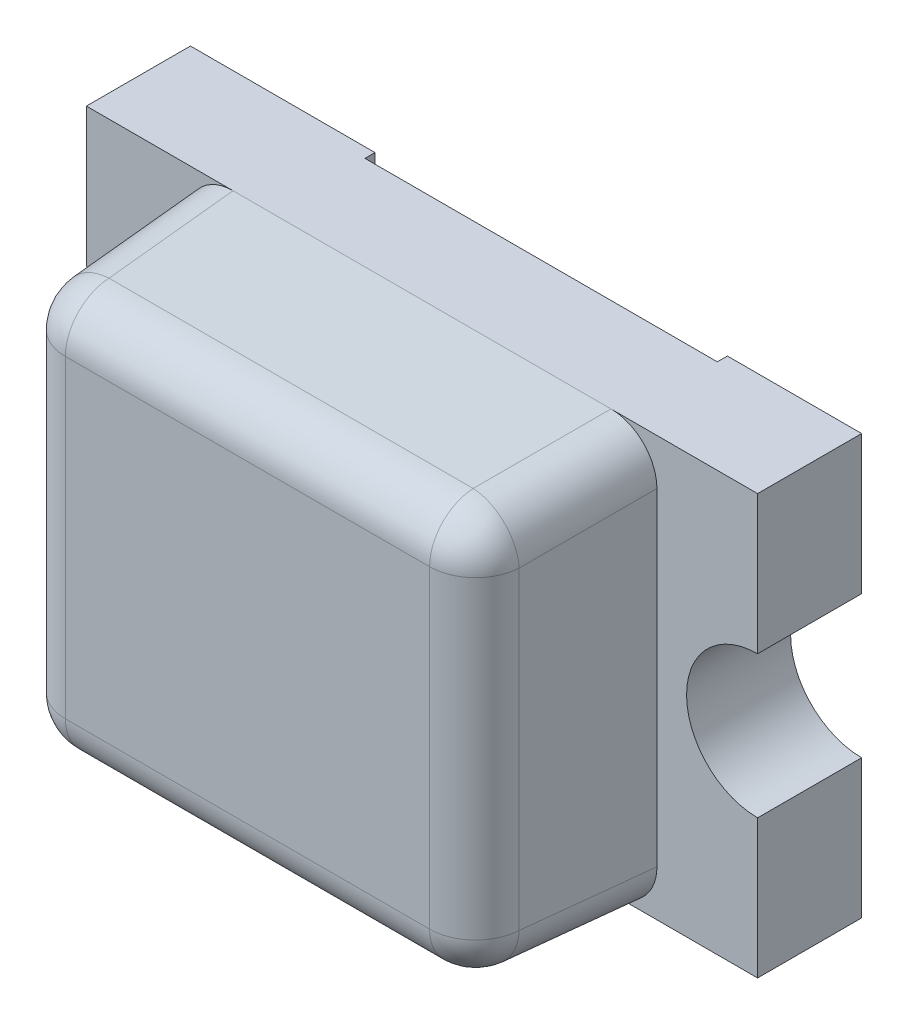
ISO-10303-21;
HEADER;
FILE_DESCRIPTION(('STEP AP214'),'2;1');
FILE_NAME('part.step','',(''),(''),'','','');
FILE_SCHEMA(('AUTOMOTIVE_DESIGN { 1 0 10303 214 1 1 1 1 }'));
ENDSEC;
DATA;
#1=APPLICATION_CONTEXT('core data for automotive mechanical design processes');
#2=APPLICATION_PROTOCOL_DEFINITION('international standard','automotive_design',2000,#1);
#3=PRODUCT_CONTEXT('',#1,'mechanical');
#4=PRODUCT('Part','Part','',(#3));
#5=PRODUCT_RELATED_PRODUCT_CATEGORY('part','',(#4));
#6=PRODUCT_DEFINITION_FORMATION('','',#4);
#7=PRODUCT_DEFINITION_CONTEXT('part definition',#1,'design');
#8=PRODUCT_DEFINITION('design','',#6,#7);
#9=PRODUCT_DEFINITION_SHAPE('','',#8);
#10=(LENGTH_UNIT() NAMED_UNIT(*) SI_UNIT(.MILLI.,.METRE.));
#11=(NAMED_UNIT(*) PLANE_ANGLE_UNIT() SI_UNIT($,.RADIAN.));
#12=(NAMED_UNIT(*) SI_UNIT($,.STERADIAN.) SOLID_ANGLE_UNIT());
#13=UNCERTAINTY_MEASURE_WITH_UNIT(LENGTH_MEASURE(1.E-05),#10,'distance_accuracy_value','');
#14=(GEOMETRIC_REPRESENTATION_CONTEXT(3) GLOBAL_UNCERTAINTY_ASSIGNED_CONTEXT((#13)) GLOBAL_UNIT_ASSIGNED_CONTEXT((#10,
#11,#12)) REPRESENTATION_CONTEXT('',''));
#15=CARTESIAN_POINT('',(0.,0.,0.));
#16=DIRECTION('',(0.,0.,1.));
#17=DIRECTION('',(1.,0.,0.));
#18=AXIS2_PLACEMENT_3D('',#15,#16,#17);
#19=CARTESIAN_POINT('',(0.163168531233106,-0.486831468766896,0.325652261310296));
#20=DIRECTION('',(-0.0522644276887139,-0.0522644276887139,-0.997264688634237));
#21=DIRECTION('',(0.,0.998629534754574,-0.0523359562429438));
#22=AXIS2_PLACEMENT_3D('',#19,#20,#21);
#23=CYLINDRICAL_SURFACE('',#22,0.13716);
#24=CARTESIAN_POINT('',(0.182412025197795,-0.467587974802207,0.69284));
#25=DIRECTION('',(0.052264427688714,0.052264427688714,0.997264688634237));
#26=DIRECTION('',(0.,-0.998629534754574,0.0523359562429439));
#27=AXIS2_PLACEMENT_3D('',#24,#25,#26);
#28=CIRCLE('',#27,0.13716);
#29=CARTESIAN_POINT('',(0.0454399982108576,-0.467587974802207,0.700018399758282));
#30=VERTEX_POINT('',#29);
#31=CARTESIAN_POINT('',(0.182412025197795,-0.604560001789144,0.700018399758282));
#32=VERTEX_POINT('',#31);
#33=EDGE_CURVE('E496',#30,#32,#28,.T.);
#34=ORIENTED_EDGE('',*,*,#33,.F.);
#35=DIRECTION('',(0.0522644276887139,0.0522644276887139,0.997264688634237));
#36=VECTOR('',#35,1.);
#37=CARTESIAN_POINT('',(0.02633308276625,-0.486694890246814,0.335436734478859));
#38=LINE('',#37,#36);
#39=CARTESIAN_POINT('',(0.0250000000000006,-0.488027973013064,0.31));
#40=VERTEX_POINT('',#39);
#41=EDGE_CURVE('E43',#40,#30,#38,.T.);
#42=ORIENTED_EDGE('',*,*,#41,.F.);
#43=CARTESIAN_POINT('',(0.162348230977076,-0.487651769022926,0.31));
#44=DIRECTION('',(0.,0.,1.));
#45=DIRECTION('',(-0.707106781186547,-0.707106781186548,0.));
#46=AXIS2_PLACEMENT_3D('',#43,#44,#45);
#47=ELLIPSE('',#46,0.137536204342943,0.13716);
#48=CARTESIAN_POINT('',(0.161972026986938,-0.625,0.31));
#49=VERTEX_POINT('',#48);
#50=EDGE_CURVE('E11',#40,#49,#47,.T.);
#51=ORIENTED_EDGE('',*,*,#50,.T.);
#52=DIRECTION('',(0.0522644276887139,0.0522644276887139,0.997264688634237));
#53=VECTOR('',#52,1.);
#54=CARTESIAN_POINT('',(0.163168531233106,-0.623803495753833,0.332830661068578));
#55=LINE('',#54,#53);
#56=EDGE_CURVE('E29',#49,#32,#55,.T.);
#57=ORIENTED_EDGE('',*,*,#56,.T.);
#58=EDGE_LOOP('',(#34,#42,#51,#57));
#59=FACE_BOUND('',#58,.T.);
#60=ADVANCED_FACE('F18',(#59),#23,.T.);
#61=CARTESIAN_POINT('',(0.182412025197795,-0.467587974802207,0.69284));
#62=DIRECTION('',(0.,0.,1.));
#63=DIRECTION('',(1.,0.,0.));
#64=AXIS2_PLACEMENT_3D('',#61,#62,#63);
#65=SPHERICAL_SURFACE('',#64,0.13716);
#66=CARTESIAN_POINT('',(0.182412025197795,-0.467587974802207,0.69284));
#67=DIRECTION('',(-1.,0.,0.));
#68=DIRECTION('',(0.,0.,1.));
#69=AXIS2_PLACEMENT_3D('',#66,#67,#68);
#70=CIRCLE('',#69,0.13716);
#71=CARTESIAN_POINT('',(0.182412025197795,-0.467587974802207,0.83));
#72=VERTEX_POINT('',#71);
#73=EDGE_CURVE('E22',#32,#72,#70,.T.);
#74=ORIENTED_EDGE('',*,*,#73,.T.);
#75=CARTESIAN_POINT('',(0.182412025197795,-0.467587974802207,0.69284));
#76=DIRECTION('',(0.,-1.,0.));
#77=DIRECTION('',(0.,0.,-1.));
#78=AXIS2_PLACEMENT_3D('',#75,#76,#77);
#79=CIRCLE('',#78,0.13716);
#80=EDGE_CURVE('E492',#72,#30,#79,.T.);
#81=ORIENTED_EDGE('',*,*,#80,.T.);
#82=ORIENTED_EDGE('',*,*,#33,.T.);
#83=EDGE_LOOP('',(#74,#81,#82));
#84=FACE_BOUND('',#83,.T.);
#85=ADVANCED_FACE('F776',(#84),#65,.T.);
#86=CARTESIAN_POINT('',(0.,-0.467587974802207,0.69284));
#87=DIRECTION('',(1.,0.,0.));
#88=DIRECTION('',(0.,1.,0.));
#89=AXIS2_PLACEMENT_3D('',#86,#87,#88);
#90=CYLINDRICAL_SURFACE('',#89,0.13716);
#91=CARTESIAN_POINT('',(1.26758797480221,-0.467587974802207,0.69284));
#92=DIRECTION('',(1.,0.,0.));
#93=DIRECTION('',(0.,0.,-1.));
#94=AXIS2_PLACEMENT_3D('',#91,#92,#93);
#95=CIRCLE('',#94,0.13716);
#96=CARTESIAN_POINT('',(1.26758797480221,-0.467587974802207,0.83));
#97=VERTEX_POINT('',#96);
#98=CARTESIAN_POINT('',(1.26758797480221,-0.604560001789144,0.700018399758282));
#99=VERTEX_POINT('',#98);
#100=EDGE_CURVE('E370',#97,#99,#95,.T.);
#101=ORIENTED_EDGE('',*,*,#100,.F.);
#102=DIRECTION('',(-1.,0.,0.));
#103=VECTOR('',#102,1.);
#104=CARTESIAN_POINT('',(1.39774795477282,-0.467587974802207,0.83));
#105=LINE('',#104,#103);
#106=EDGE_CURVE('E297',#97,#72,#105,.T.);
#107=ORIENTED_EDGE('',*,*,#106,.T.);
#108=ORIENTED_EDGE('',*,*,#73,.F.);
#109=DIRECTION('',(1.,0.,0.));
#110=VECTOR('',#109,1.);
#111=CARTESIAN_POINT('',(0.0522520452271821,-0.604560001789144,0.700018399758282));
#112=LINE('',#111,#110);
#113=EDGE_CURVE('E444',#32,#99,#112,.T.);
#114=ORIENTED_EDGE('',*,*,#113,.T.);
#115=EDGE_LOOP('',(#101,#107,#108,#114));
#116=FACE_BOUND('',#115,.T.);
#117=ADVANCED_FACE('F781',(#116),#90,.T.);
#118=CARTESIAN_POINT('',(0.182412025197795,0.,0.69284));
#119=DIRECTION('',(0.,-1.,0.));
#120=DIRECTION('',(1.,0.,0.));
#121=AXIS2_PLACEMENT_3D('',#118,#119,#120);
#122=CYLINDRICAL_SURFACE('',#121,0.13716);
#123=CARTESIAN_POINT('',(0.182412025197795,0.467587974802206,0.69284));
#124=DIRECTION('',(0.,1.,0.));
#125=DIRECTION('',(0.,0.,1.));
#126=AXIS2_PLACEMENT_3D('',#123,#124,#125);
#127=CIRCLE('',#126,0.13716);
#128=CARTESIAN_POINT('',(0.0454399982108576,0.467587974802206,0.700018399758282));
#129=VERTEX_POINT('',#128);
#130=CARTESIAN_POINT('',(0.182412025197795,0.467587974802206,0.83));
#131=VERTEX_POINT('',#130);
#132=EDGE_CURVE('E279',#129,#131,#127,.T.);
#133=ORIENTED_EDGE('',*,*,#132,.F.);
#134=DIRECTION('',(0.,-1.,0.));
#135=VECTOR('',#134,1.);
#136=CARTESIAN_POINT('',(0.0454399982108575,0.597747954772819,0.700018399758282));
#137=LINE('',#136,#135);
#138=EDGE_CURVE('E345',#129,#30,#137,.T.);
#139=ORIENTED_EDGE('',*,*,#138,.T.);
#140=ORIENTED_EDGE('',*,*,#80,.F.);
#141=DIRECTION('',(0.,1.,0.));
#142=VECTOR('',#141,1.);
#143=CARTESIAN_POINT('',(0.182412025197795,-0.597747954772819,0.83));
#144=LINE('',#143,#142);
#145=EDGE_CURVE('E341',#72,#131,#144,.T.);
#146=ORIENTED_EDGE('',*,*,#145,.T.);
#147=EDGE_LOOP('',(#133,#139,#140,#146));
#148=FACE_BOUND('',#147,.T.);
#149=ADVANCED_FACE('F795',(#148),#122,.T.);
#150=CARTESIAN_POINT('',(1.26758797480221,-0.467587974802207,0.69284));
#151=DIRECTION('',(0.,0.,1.));
#152=DIRECTION('',(1.,0.,0.));
#153=AXIS2_PLACEMENT_3D('',#150,#151,#152);
#154=SPHERICAL_SURFACE('',#153,0.13716);
#155=CARTESIAN_POINT('',(1.26758797480221,-0.467587974802206,0.69284));
#156=DIRECTION('',(-0.052264427688714,0.052264427688714,0.997264688634237));
#157=DIRECTION('',(0.,-0.998629534754574,0.0523359562429439));
#158=AXIS2_PLACEMENT_3D('',#155,#156,#157);
#159=CIRCLE('',#158,0.13716);
#160=CARTESIAN_POINT('',(1.40456000178914,-0.467587974802207,0.700018399758282));
#161=VERTEX_POINT('',#160);
#162=EDGE_CURVE('E346',#99,#161,#159,.T.);
#163=ORIENTED_EDGE('',*,*,#162,.T.);
#164=CARTESIAN_POINT('',(1.26758797480221,-0.467587974802207,0.69284));
#165=DIRECTION('',(0.,-1.,0.));
#166=DIRECTION('',(0.,0.,-1.));
#167=AXIS2_PLACEMENT_3D('',#164,#165,#166);
#168=CIRCLE('',#167,0.13716);
#169=EDGE_CURVE('E372',#161,#97,#168,.T.);
#170=ORIENTED_EDGE('',*,*,#169,.T.);
#171=ORIENTED_EDGE('',*,*,#100,.T.);
#172=EDGE_LOOP('',(#163,#170,#171));
#173=FACE_BOUND('',#172,.T.);
#174=ADVANCED_FACE('F789',(#173),#154,.T.);
#175=CARTESIAN_POINT('',(0.182412025197795,0.467587974802206,0.69284));
#176=DIRECTION('',(0.,0.,1.));
#177=DIRECTION('',(1.,0.,0.));
#178=AXIS2_PLACEMENT_3D('',#175,#176,#177);
#179=SPHERICAL_SURFACE('',#178,0.13716);
#180=CARTESIAN_POINT('',(0.182412025197795,0.467587974802206,0.69284));
#181=DIRECTION('',(-1.,0.,0.));
#182=DIRECTION('',(0.,-1.,0.));
#183=AXIS2_PLACEMENT_3D('',#180,#181,#182);
#184=CIRCLE('',#183,0.13716);
#185=CARTESIAN_POINT('',(0.182412025197795,0.604560001789144,0.700018399758282));
#186=VERTEX_POINT('',#185);
#187=EDGE_CURVE('E366',#131,#186,#184,.T.);
#188=ORIENTED_EDGE('',*,*,#187,.T.);
#189=CARTESIAN_POINT('',(0.182412025197795,0.467587974802206,0.69284));
#190=DIRECTION('',(0.052264427688714,-0.052264427688714,0.997264688634237));
#191=DIRECTION('',(0.998629534754574,0.,-0.0523359562429439));
#192=AXIS2_PLACEMENT_3D('',#189,#190,#191);
#193=CIRCLE('',#192,0.13716);
#194=EDGE_CURVE('E371',#186,#129,#193,.T.);
#195=ORIENTED_EDGE('',*,*,#194,.T.);
#196=ORIENTED_EDGE('',*,*,#132,.T.);
#197=EDGE_LOOP('',(#188,#195,#196));
#198=FACE_BOUND('',#197,.T.);
#199=ADVANCED_FACE('F794',(#198),#179,.T.);
#200=CARTESIAN_POINT('',(1.28669489024681,-0.486694890246814,0.328258334720577));
#201=DIRECTION('',(0.0522644276887139,-0.0522644276887139,-0.997264688634237));
#202=DIRECTION('',(-0.998629534754574,0.,-0.0523359562429438));
#203=AXIS2_PLACEMENT_3D('',#200,#201,#202);
#204=CYLINDRICAL_SURFACE('',#203,0.13716);
#205=CARTESIAN_POINT('',(1.28765176902293,-0.487651769022926,0.31));
#206=DIRECTION('',(0.,0.,1.));
#207=DIRECTION('',(0.707106781186548,-0.707106781186547,0.));
#208=AXIS2_PLACEMENT_3D('',#205,#206,#207);
#209=ELLIPSE('',#208,0.137536204342943,0.13716);
#210=CARTESIAN_POINT('',(1.28802797301306,-0.625,0.31));
#211=VERTEX_POINT('',#210);
#212=CARTESIAN_POINT('',(1.425,-0.488027973013063,0.31));
#213=VERTEX_POINT('',#212);
#214=EDGE_CURVE('E270',#211,#213,#209,.T.);
#215=ORIENTED_EDGE('',*,*,#214,.T.);
#216=DIRECTION('',(-0.0522644276887139,0.0522644276887139,0.997264688634237));
#217=VECTOR('',#216,1.);
#218=CARTESIAN_POINT('',(1.42366691723375,-0.486694890246814,0.335436734478859));
#219=LINE('',#218,#217);
#220=EDGE_CURVE('E268',#213,#161,#219,.T.);
#221=ORIENTED_EDGE('',*,*,#220,.T.);
#222=ORIENTED_EDGE('',*,*,#162,.F.);
#223=DIRECTION('',(-0.0522644276887139,0.0522644276887139,0.997264688634237));
#224=VECTOR('',#223,1.);
#225=CARTESIAN_POINT('',(1.28614857616649,-0.623120603153426,0.345861028119986));
#226=LINE('',#225,#224);
#227=EDGE_CURVE('E383',#211,#99,#226,.T.);
#228=ORIENTED_EDGE('',*,*,#227,.F.);
#229=EDGE_LOOP('',(#215,#221,#222,#228));
#230=FACE_BOUND('',#229,.T.);
#231=ADVANCED_FACE('F639',(#230),#204,.T.);
#232=CARTESIAN_POINT('',(1.26758797480221,0.,0.69284));
#233=DIRECTION('',(0.,1.,0.));
#234=DIRECTION('',(-1.,0.,0.));
#235=AXIS2_PLACEMENT_3D('',#232,#233,#234);
#236=CYLINDRICAL_SURFACE('',#235,0.13716);
#237=CARTESIAN_POINT('',(1.26758797480221,0.467587974802206,0.69284));
#238=DIRECTION('',(0.,1.,0.));
#239=DIRECTION('',(0.,0.,1.));
#240=AXIS2_PLACEMENT_3D('',#237,#238,#239);
#241=CIRCLE('',#240,0.13716);
#242=CARTESIAN_POINT('',(1.26758797480221,0.467587974802206,0.83));
#243=VERTEX_POINT('',#242);
#244=CARTESIAN_POINT('',(1.40456000178914,0.467587974802206,0.700018399758282));
#245=VERTEX_POINT('',#244);
#246=EDGE_CURVE('E312',#243,#245,#241,.T.);
#247=ORIENTED_EDGE('',*,*,#246,.F.);
#248=DIRECTION('',(0.,-1.,0.));
#249=VECTOR('',#248,1.);
#250=CARTESIAN_POINT('',(1.26758797480221,0.597747954772819,0.83));
#251=LINE('',#250,#249);
#252=EDGE_CURVE('E271',#243,#97,#251,.T.);
#253=ORIENTED_EDGE('',*,*,#252,.T.);
#254=ORIENTED_EDGE('',*,*,#169,.F.);
#255=DIRECTION('',(0.,1.,0.));
#256=VECTOR('',#255,1.);
#257=CARTESIAN_POINT('',(1.40456000178914,-0.597747954772819,0.700018399758282));
#258=LINE('',#257,#256);
#259=EDGE_CURVE('E283',#161,#245,#258,.T.);
#260=ORIENTED_EDGE('',*,*,#259,.T.);
#261=EDGE_LOOP('',(#247,#253,#254,#260));
#262=FACE_BOUND('',#261,.T.);
#263=ADVANCED_FACE('F763',(#262),#236,.T.);
#264=CARTESIAN_POINT('',(0.,0.467587974802206,0.69284));
#265=DIRECTION('',(-1.,0.,0.));
#266=DIRECTION('',(0.,0.,1.));
#267=AXIS2_PLACEMENT_3D('',#264,#265,#266);
#268=CYLINDRICAL_SURFACE('',#267,0.13716);
#269=CARTESIAN_POINT('',(1.26758797480221,0.467587974802206,0.69284));
#270=DIRECTION('',(1.,0.,0.));
#271=DIRECTION('',(0.,0.,-1.));
#272=AXIS2_PLACEMENT_3D('',#269,#270,#271);
#273=CIRCLE('',#272,0.13716);
#274=CARTESIAN_POINT('',(1.26758797480221,0.604560001789144,0.700018399758282));
#275=VERTEX_POINT('',#274);
#276=EDGE_CURVE('E299',#275,#243,#273,.T.);
#277=ORIENTED_EDGE('',*,*,#276,.F.);
#278=DIRECTION('',(-1.,0.,0.));
#279=VECTOR('',#278,1.);
#280=CARTESIAN_POINT('',(1.39774795477282,0.604560001789144,0.700018399758282));
#281=LINE('',#280,#279);
#282=EDGE_CURVE('E293',#275,#186,#281,.T.);
#283=ORIENTED_EDGE('',*,*,#282,.T.);
#284=ORIENTED_EDGE('',*,*,#187,.F.);
#285=DIRECTION('',(1.,0.,0.));
#286=VECTOR('',#285,1.);
#287=CARTESIAN_POINT('',(0.052252045227182,0.467587974802206,0.83));
#288=LINE('',#287,#286);
#289=EDGE_CURVE('E447',#131,#243,#288,.T.);
#290=ORIENTED_EDGE('',*,*,#289,.T.);
#291=EDGE_LOOP('',(#277,#283,#284,#290));
#292=FACE_BOUND('',#291,.T.);
#293=ADVANCED_FACE('F768',(#292),#268,.T.);
#294=CARTESIAN_POINT('',(0.163305109753187,0.486694890246814,0.328258334720577));
#295=DIRECTION('',(-0.0522644276887139,0.0522644276887139,-0.997264688634237));
#296=DIRECTION('',(-0.998629534754574,0.,0.0523359562429438));
#297=AXIS2_PLACEMENT_3D('',#294,#295,#296);
#298=CYLINDRICAL_SURFACE('',#297,0.13716);
#299=CARTESIAN_POINT('',(0.162348230977075,0.487651769022926,0.31));
#300=DIRECTION('',(0.,0.,1.));
#301=DIRECTION('',(-0.707106781186548,0.707106781186548,0.));
#302=AXIS2_PLACEMENT_3D('',#299,#300,#301);
#303=ELLIPSE('',#302,0.137536204342943,0.13716);
#304=CARTESIAN_POINT('',(0.161972026986938,0.625,0.31));
#305=VERTEX_POINT('',#304);
#306=CARTESIAN_POINT('',(0.0250000000000006,0.488027973013063,0.31));
#307=VERTEX_POINT('',#306);
#308=EDGE_CURVE('E549',#305,#307,#303,.T.);
#309=ORIENTED_EDGE('',*,*,#308,.T.);
#310=DIRECTION('',(0.0522644276887139,-0.0522644276887139,0.997264688634237));
#311=VECTOR('',#310,1.);
#312=CARTESIAN_POINT('',(0.02633308276625,0.486694890246814,0.335436734478859));
#313=LINE('',#312,#311);
#314=EDGE_CURVE('E262',#307,#129,#313,.T.);
#315=ORIENTED_EDGE('',*,*,#314,.T.);
#316=ORIENTED_EDGE('',*,*,#194,.F.);
#317=DIRECTION('',(0.0522644276887139,-0.0522644276887139,0.997264688634237));
#318=VECTOR('',#317,1.);
#319=CARTESIAN_POINT('',(0.163168531233106,0.623803495753833,0.332830661068578));
#320=LINE('',#319,#318);
#321=EDGE_CURVE('E412',#305,#186,#320,.T.);
#322=ORIENTED_EDGE('',*,*,#321,.F.);
#323=EDGE_LOOP('',(#309,#315,#316,#322));
#324=FACE_BOUND('',#323,.T.);
#325=ADVANCED_FACE('F596',(#324),#298,.T.);
#326=CARTESIAN_POINT('',(1.26758797480221,0.467587974802206,0.69284));
#327=DIRECTION('',(0.,0.,1.));
#328=DIRECTION('',(1.,0.,0.));
#329=AXIS2_PLACEMENT_3D('',#326,#327,#328);
#330=SPHERICAL_SURFACE('',#329,0.13716);
#331=ORIENTED_EDGE('',*,*,#246,.T.);
#332=CARTESIAN_POINT('',(1.26758797480221,0.467587974802206,0.69284));
#333=DIRECTION('',(-0.052264427688714,-0.0522644276887141,0.997264688634237));
#334=DIRECTION('',(0.,-0.998629534754574,-0.052335956242944));
#335=AXIS2_PLACEMENT_3D('',#332,#333,#334);
#336=CIRCLE('',#335,0.13716);
#337=EDGE_CURVE('E301',#245,#275,#336,.T.);
#338=ORIENTED_EDGE('',*,*,#337,.T.);
#339=ORIENTED_EDGE('',*,*,#276,.T.);
#340=EDGE_LOOP('',(#331,#338,#339));
#341=FACE_BOUND('',#340,.T.);
#342=ADVANCED_FACE('F739',(#341),#330,.T.);
#343=CARTESIAN_POINT('',(1.28614857616649,0.486148576166488,0.338682628361704));
#344=DIRECTION('',(0.0522644276887139,0.0522644276887139,-0.997264688634237));
#345=DIRECTION('',(0.,0.998629534754574,0.0523359562429438));
#346=AXIS2_PLACEMENT_3D('',#343,#344,#345);
#347=CYLINDRICAL_SURFACE('',#346,0.13716);
#348=ORIENTED_EDGE('',*,*,#337,.F.);
#349=DIRECTION('',(-0.0522644276887139,-0.0522644276887139,0.997264688634237));
#350=VECTOR('',#349,1.);
#351=CARTESIAN_POINT('',(1.42366691723375,0.486694890246814,0.335436734478859));
#352=LINE('',#351,#350);
#353=CARTESIAN_POINT('',(1.425,0.488027973013063,0.31));
#354=VERTEX_POINT('',#353);
#355=EDGE_CURVE('E387',#354,#245,#352,.T.);
#356=ORIENTED_EDGE('',*,*,#355,.F.);
#357=CARTESIAN_POINT('',(1.28765176902293,0.487651769022926,0.31));
#358=DIRECTION('',(0.,0.,1.));
#359=DIRECTION('',(0.707106781186548,0.707106781186548,0.));
#360=AXIS2_PLACEMENT_3D('',#357,#358,#359);
#361=ELLIPSE('',#360,0.137536204342943,0.13716);
#362=CARTESIAN_POINT('',(1.28802797301306,0.625,0.31));
#363=VERTEX_POINT('',#362);
#364=EDGE_CURVE('E302',#354,#363,#361,.T.);
#365=ORIENTED_EDGE('',*,*,#364,.T.);
#366=DIRECTION('',(-0.0522644276887139,-0.0522644276887139,0.997264688634237));
#367=VECTOR('',#366,1.);
#368=CARTESIAN_POINT('',(1.28614857616649,0.623120603153425,0.345861028119986));
#369=LINE('',#368,#367);
#370=EDGE_CURVE('E408',#363,#275,#369,.T.);
#371=ORIENTED_EDGE('',*,*,#370,.T.);
#372=EDGE_LOOP('',(#348,#356,#365,#371));
#373=FACE_BOUND('',#372,.T.);
#374=ADVANCED_FACE('F632',(#373),#347,.T.);
#375=CARTESIAN_POINT('',(0.,0.,0.83));
#376=DIRECTION('',(0.,0.,1.));
#377=DIRECTION('',(1.,0.,0.));
#378=AXIS2_PLACEMENT_3D('',#375,#376,#377);
#379=PLANE('',#378);
#380=ORIENTED_EDGE('',*,*,#145,.F.);
#381=ORIENTED_EDGE('',*,*,#106,.F.);
#382=ORIENTED_EDGE('',*,*,#252,.F.);
#383=ORIENTED_EDGE('',*,*,#289,.F.);
#384=EDGE_LOOP('',(#380,#381,#382,#383));
#385=FACE_BOUND('',#384,.T.);
#386=ADVANCED_FACE('F816',(#385),#379,.T.);
#387=CARTESIAN_POINT('',(0.6,0.625,0.31));
#388=DIRECTION('',(0.,0.998629534754574,0.0523359562429438));
#389=DIRECTION('',(1.,0.,0.));
#390=AXIS2_PLACEMENT_3D('',#387,#388,#389);
#391=PLANE('',#390);
#392=DIRECTION('',(1.,0.,0.));
#393=VECTOR('',#392,1.);
#394=CARTESIAN_POINT('',(0.6,0.625,0.31));
#395=LINE('',#394,#393);
#396=EDGE_CURVE('E236',#305,#363,#395,.T.);
#397=ORIENTED_EDGE('',*,*,#396,.F.);
#398=ORIENTED_EDGE('',*,*,#321,.T.);
#399=ORIENTED_EDGE('',*,*,#282,.F.);
#400=ORIENTED_EDGE('',*,*,#370,.F.);
#401=EDGE_LOOP('',(#397,#398,#399,#400));
#402=FACE_BOUND('',#401,.T.);
#403=ADVANCED_FACE('F821',(#402),#391,.T.);
#404=CARTESIAN_POINT('',(1.425,0.,0.31));
#405=DIRECTION('',(0.998629534754574,0.,0.0523359562429438));
#406=DIRECTION('',(0.,-1.,0.));
#407=AXIS2_PLACEMENT_3D('',#404,#405,#406);
#408=PLANE('',#407);
#409=ORIENTED_EDGE('',*,*,#259,.F.);
#410=ORIENTED_EDGE('',*,*,#220,.F.);
#411=DIRECTION('',(0.,-1.,0.));
#412=VECTOR('',#411,1.);
#413=CARTESIAN_POINT('',(1.425,0.,0.31));
#414=LINE('',#413,#412);
#415=EDGE_CURVE('E336',#354,#213,#414,.T.);
#416=ORIENTED_EDGE('',*,*,#415,.F.);
#417=ORIENTED_EDGE('',*,*,#355,.T.);
#418=EDGE_LOOP('',(#409,#410,#416,#417));
#419=FACE_BOUND('',#418,.T.);
#420=ADVANCED_FACE('F637',(#419),#408,.T.);
#421=CARTESIAN_POINT('',(0.6,-0.625,0.31));
#422=DIRECTION('',(0.,-0.998629534754574,0.0523359562429438));
#423=DIRECTION('',(-1.,0.,0.));
#424=AXIS2_PLACEMENT_3D('',#421,#422,#423);
#425=PLANE('',#424);
#426=ORIENTED_EDGE('',*,*,#113,.F.);
#427=ORIENTED_EDGE('',*,*,#56,.F.);
#428=DIRECTION('',(-1.,0.,0.));
#429=VECTOR('',#428,1.);
#430=CARTESIAN_POINT('',(0.6,-0.625,0.31));
#431=LINE('',#430,#429);
#432=EDGE_CURVE('E328',#211,#49,#431,.T.);
#433=ORIENTED_EDGE('',*,*,#432,.F.);
#434=ORIENTED_EDGE('',*,*,#227,.T.);
#435=EDGE_LOOP('',(#426,#427,#433,#434));
#436=FACE_BOUND('',#435,.T.);
#437=ADVANCED_FACE('F808',(#436),#425,.T.);
#438=CARTESIAN_POINT('',(0.0250000000000006,0.,0.31));
#439=DIRECTION('',(-0.998629534754574,0.,0.0523359562429438));
#440=DIRECTION('',(0.,1.,0.));
#441=AXIS2_PLACEMENT_3D('',#438,#439,#440);
#442=PLANE('',#441);
#443=DIRECTION('',(0.,1.,0.));
#444=VECTOR('',#443,1.);
#445=CARTESIAN_POINT('',(0.0250000000000006,0.,0.31));
#446=LINE('',#445,#444);
#447=EDGE_CURVE('E349',#40,#307,#446,.T.);
#448=ORIENTED_EDGE('',*,*,#447,.F.);
#449=ORIENTED_EDGE('',*,*,#41,.T.);
#450=ORIENTED_EDGE('',*,*,#138,.F.);
#451=ORIENTED_EDGE('',*,*,#314,.F.);
#452=EDGE_LOOP('',(#448,#449,#450,#451));
#453=FACE_BOUND('',#452,.T.);
#454=ADVANCED_FACE('F591',(#453),#442,.T.);
#455=CARTESIAN_POINT('',(-0.275,0.,0.));
#456=DIRECTION('',(0.,0.,1.));
#457=DIRECTION('',(1.,0.,0.));
#458=AXIS2_PLACEMENT_3D('',#455,#456,#457);
#459=PLANE('',#458);
#460=DIRECTION('',(0.,1.,0.));
#461=VECTOR('',#460,1.);
#462=CARTESIAN_POINT('',(-0.275,0.211688070581402,0.));
#463=LINE('',#462,#461);
#464=CARTESIAN_POINT('',(-0.275,0.211688070581401,0.));
#465=VERTEX_POINT('',#464);
#466=CARTESIAN_POINT('',(-0.275,0.625,0.));
#467=VERTEX_POINT('',#466);
#468=EDGE_CURVE('E307',#465,#467,#463,.T.);
#469=ORIENTED_EDGE('',*,*,#468,.T.);
#470=DIRECTION('',(1.,0.,0.));
#471=VECTOR('',#470,1.);
#472=CARTESIAN_POINT('',(-0.275,0.625,0.));
#473=LINE('',#472,#471);
#474=CARTESIAN_POINT('',(0.275,0.625,0.));
#475=VERTEX_POINT('',#474);
#476=EDGE_CURVE('E303',#467,#475,#473,.T.);
#477=ORIENTED_EDGE('',*,*,#476,.T.);
#478=DIRECTION('',(0.,-1.,0.));
#479=VECTOR('',#478,1.);
#480=CARTESIAN_POINT('',(0.275,0.625,0.));
#481=LINE('',#480,#479);
#482=CARTESIAN_POINT('',(0.275,-0.625,0.));
#483=VERTEX_POINT('',#482);
#484=EDGE_CURVE('E308',#475,#483,#481,.T.);
#485=ORIENTED_EDGE('',*,*,#484,.T.);
#486=DIRECTION('',(-1.,0.,0.));
#487=VECTOR('',#486,1.);
#488=CARTESIAN_POINT('',(0.275,-0.625,0.));
#489=LINE('',#488,#487);
#490=CARTESIAN_POINT('',(-0.275,-0.625,0.));
#491=VERTEX_POINT('',#490);
#492=EDGE_CURVE('E402',#483,#491,#489,.T.);
#493=ORIENTED_EDGE('',*,*,#492,.T.);
#494=DIRECTION('',(0.,1.,0.));
#495=VECTOR('',#494,1.);
#496=CARTESIAN_POINT('',(-0.275,-0.625,0.));
#497=LINE('',#496,#495);
#498=CARTESIAN_POINT('',(-0.275,-0.211688070581402,0.));
#499=VERTEX_POINT('',#498);
#500=EDGE_CURVE('E323',#491,#499,#497,.T.);
#501=ORIENTED_EDGE('',*,*,#500,.T.);
#502=CARTESIAN_POINT('',(-0.275,0.,0.));
#503=DIRECTION('',(0.,0.,1.));
#504=DIRECTION('',(-1.,0.,0.));
#505=AXIS2_PLACEMENT_3D('',#502,#503,#504);
#506=CIRCLE('',#505,0.211688070581401);
#507=EDGE_CURVE('E319',#499,#465,#506,.T.);
#508=ORIENTED_EDGE('',*,*,#507,.T.);
#509=EDGE_LOOP('',(#469,#477,#485,#493,#501,#508));
#510=FACE_BOUND('',#509,.T.);
#511=ADVANCED_FACE('F656',(#510),#459,.F.);
#512=CARTESIAN_POINT('',(-0.275,0.,0.03));
#513=DIRECTION('',(0.,0.,-1.));
#514=DIRECTION('',(-1.,0.,0.));
#515=AXIS2_PLACEMENT_3D('',#512,#513,#514);
#516=CYLINDRICAL_SURFACE('',#515,0.211688070581401);
#517=ORIENTED_EDGE('',*,*,#507,.F.);
#518=DIRECTION('',(0.,0.,-1.));
#519=VECTOR('',#518,1.);
#520=CARTESIAN_POINT('',(-0.275,-0.211688070581402,0.03));
#521=LINE('',#520,#519);
#522=CARTESIAN_POINT('',(-0.275,-0.211688070581402,0.31));
#523=VERTEX_POINT('',#522);
#524=EDGE_CURVE('E381',#523,#499,#521,.T.);
#525=ORIENTED_EDGE('',*,*,#524,.F.);
#526=CARTESIAN_POINT('',(-0.275,0.,0.31));
#527=DIRECTION('',(0.,0.,1.));
#528=DIRECTION('',(-1.,0.,0.));
#529=AXIS2_PLACEMENT_3D('',#526,#527,#528);
#530=CIRCLE('',#529,0.211688070581401);
#531=CARTESIAN_POINT('',(-0.275,0.211688070581401,0.31));
#532=VERTEX_POINT('',#531);
#533=EDGE_CURVE('E317',#523,#532,#530,.T.);
#534=ORIENTED_EDGE('',*,*,#533,.T.);
#535=DIRECTION('',(0.,0.,-1.));
#536=VECTOR('',#535,1.);
#537=CARTESIAN_POINT('',(-0.275,0.211688070581401,0.03));
#538=LINE('',#537,#536);
#539=EDGE_CURVE('E313',#532,#465,#538,.T.);
#540=ORIENTED_EDGE('',*,*,#539,.T.);
#541=EDGE_LOOP('',(#517,#525,#534,#540));
#542=FACE_BOUND('',#541,.T.);
#543=ADVANCED_FACE('F573',(#542),#516,.F.);
#544=CARTESIAN_POINT('',(-0.275,-0.625,0.03));
#545=DIRECTION('',(-1.,0.,0.));
#546=DIRECTION('',(0.,0.,1.));
#547=AXIS2_PLACEMENT_3D('',#544,#545,#546);
#548=PLANE('',#547);
#549=ORIENTED_EDGE('',*,*,#500,.F.);
#550=DIRECTION('',(0.,0.,-1.));
#551=VECTOR('',#550,1.);
#552=CARTESIAN_POINT('',(-0.275,-0.625,0.03));
#553=LINE('',#552,#551);
#554=CARTESIAN_POINT('',(-0.275,-0.625,0.31));
#555=VERTEX_POINT('',#554);
#556=EDGE_CURVE('E329',#555,#491,#553,.T.);
#557=ORIENTED_EDGE('',*,*,#556,.F.);
#558=DIRECTION('',(0.,1.,0.));
#559=VECTOR('',#558,1.);
#560=CARTESIAN_POINT('',(-0.275,-0.211688070581402,0.31));
#561=LINE('',#560,#559);
#562=EDGE_CURVE('E318',#555,#523,#561,.T.);
#563=ORIENTED_EDGE('',*,*,#562,.T.);
#564=ORIENTED_EDGE('',*,*,#524,.T.);
#565=EDGE_LOOP('',(#549,#557,#563,#564));
#566=FACE_BOUND('',#565,.T.);
#567=ADVANCED_FACE('F579',(#566),#548,.T.);
#568=CARTESIAN_POINT('',(0.275,-0.625,0.03));
#569=DIRECTION('',(0.,-1.,0.));
#570=DIRECTION('',(0.,0.,-1.));
#571=AXIS2_PLACEMENT_3D('',#568,#569,#570);
#572=PLANE('',#571);
#573=ORIENTED_EDGE('',*,*,#492,.F.);
#574=DIRECTION('',(0.,0.,-1.));
#575=VECTOR('',#574,1.);
#576=CARTESIAN_POINT('',(0.275,-0.625,0.03));
#577=LINE('',#576,#575);
#578=CARTESIAN_POINT('',(0.275,-0.625,0.03));
#579=VERTEX_POINT('',#578);
#580=EDGE_CURVE('E461',#579,#483,#577,.T.);
#581=ORIENTED_EDGE('',*,*,#580,.F.);
#582=DIRECTION('',(-1.,0.,0.));
#583=VECTOR('',#582,1.);
#584=CARTESIAN_POINT('',(1.725,-0.625,0.03));
#585=LINE('',#584,#583);
#586=CARTESIAN_POINT('',(1.325,-0.625,0.03));
#587=VERTEX_POINT('',#586);
#588=EDGE_CURVE('E339',#587,#579,#585,.T.);
#589=ORIENTED_EDGE('',*,*,#588,.F.);
#590=DIRECTION('',(0.,0.,-1.));
#591=VECTOR('',#590,1.);
#592=CARTESIAN_POINT('',(1.325,-0.625,0.03));
#593=LINE('',#592,#591);
#594=CARTESIAN_POINT('',(1.325,-0.625,0.));
#595=VERTEX_POINT('',#594);
#596=EDGE_CURVE('E365',#587,#595,#593,.T.);
#597=ORIENTED_EDGE('',*,*,#596,.T.);
#598=DIRECTION('',(-1.,0.,0.));
#599=VECTOR('',#598,1.);
#600=CARTESIAN_POINT('',(1.725,-0.625,0.));
#601=LINE('',#600,#599);
#602=CARTESIAN_POINT('',(1.725,-0.625,0.));
#603=VERTEX_POINT('',#602);
#604=EDGE_CURVE('E351',#603,#595,#601,.T.);
#605=ORIENTED_EDGE('',*,*,#604,.F.);
#606=DIRECTION('',(0.,0.,-1.));
#607=VECTOR('',#606,1.);
#608=CARTESIAN_POINT('',(1.725,-0.625,0.03));
#609=LINE('',#608,#607);
#610=CARTESIAN_POINT('',(1.725,-0.625,0.31));
#611=VERTEX_POINT('',#610);
#612=EDGE_CURVE('E505',#611,#603,#609,.T.);
#613=ORIENTED_EDGE('',*,*,#612,.F.);
#614=DIRECTION('',(-1.,0.,0.));
#615=VECTOR('',#614,1.);
#616=CARTESIAN_POINT('',(1.725,-0.625,0.31));
#617=LINE('',#616,#615);
#618=EDGE_CURVE('E361',#611,#211,#617,.T.);
#619=ORIENTED_EDGE('',*,*,#618,.T.);
#620=ORIENTED_EDGE('',*,*,#432,.T.);
#621=DIRECTION('',(-1.,0.,0.));
#622=VECTOR('',#621,1.);
#623=CARTESIAN_POINT('',(1.725,-0.625,0.31));
#624=LINE('',#623,#622);
#625=EDGE_CURVE('E324',#49,#555,#624,.T.);
#626=ORIENTED_EDGE('',*,*,#625,.T.);
#627=ORIENTED_EDGE('',*,*,#556,.T.);
#628=EDGE_LOOP('',(#573,#581,#589,#597,#605,#613,#619,#620,#626,#627));
#629=FACE_BOUND('',#628,.T.);
#630=ADVANCED_FACE('F20',(#629),#572,.T.);
#631=CARTESIAN_POINT('',(0.275,0.625,0.03));
#632=DIRECTION('',(1.,0.,0.));
#633=DIRECTION('',(0.,1.,0.));
#634=AXIS2_PLACEMENT_3D('',#631,#632,#633);
#635=PLANE('',#634);
#636=ORIENTED_EDGE('',*,*,#484,.F.);
#637=DIRECTION('',(0.,0.,-1.));
#638=VECTOR('',#637,1.);
#639=CARTESIAN_POINT('',(0.275,0.625,0.03));
#640=LINE('',#639,#638);
#641=CARTESIAN_POINT('',(0.275,0.625,0.03));
#642=VERTEX_POINT('',#641);
#643=EDGE_CURVE('E230',#642,#475,#640,.T.);
#644=ORIENTED_EDGE('',*,*,#643,.F.);
#645=DIRECTION('',(0.,-1.,0.));
#646=VECTOR('',#645,1.);
#647=CARTESIAN_POINT('',(0.275,0.625,0.03));
#648=LINE('',#647,#646);
#649=EDGE_CURVE('E465',#642,#579,#648,.T.);
#650=ORIENTED_EDGE('',*,*,#649,.T.);
#651=ORIENTED_EDGE('',*,*,#580,.T.);
#652=EDGE_LOOP('',(#636,#644,#650,#651));
#653=FACE_BOUND('',#652,.T.);
#654=ADVANCED_FACE('F658',(#653),#635,.T.);
#655=CARTESIAN_POINT('',(-0.275,0.625,0.03));
#656=DIRECTION('',(0.,1.,0.));
#657=DIRECTION('',(1.,0.,0.));
#658=AXIS2_PLACEMENT_3D('',#655,#656,#657);
#659=PLANE('',#658);
#660=ORIENTED_EDGE('',*,*,#476,.F.);
#661=DIRECTION('',(0.,0.,-1.));
#662=VECTOR('',#661,1.);
#663=CARTESIAN_POINT('',(-0.275,0.625,0.03));
#664=LINE('',#663,#662);
#665=CARTESIAN_POINT('',(-0.275,0.625,0.31));
#666=VERTEX_POINT('',#665);
#667=EDGE_CURVE('E407',#666,#467,#664,.T.);
#668=ORIENTED_EDGE('',*,*,#667,.F.);
#669=DIRECTION('',(1.,0.,0.));
#670=VECTOR('',#669,1.);
#671=CARTESIAN_POINT('',(-0.275,0.625,0.31));
#672=LINE('',#671,#670);
#673=EDGE_CURVE('E420',#666,#305,#672,.T.);
#674=ORIENTED_EDGE('',*,*,#673,.T.);
#675=ORIENTED_EDGE('',*,*,#396,.T.);
#676=DIRECTION('',(1.,0.,0.));
#677=VECTOR('',#676,1.);
#678=CARTESIAN_POINT('',(-0.275,0.625,0.31));
#679=LINE('',#678,#677);
#680=CARTESIAN_POINT('',(1.725,0.625,0.31));
#681=VERTEX_POINT('',#680);
#682=EDGE_CURVE('E229',#363,#681,#679,.T.);
#683=ORIENTED_EDGE('',*,*,#682,.T.);
#684=DIRECTION('',(0.,0.,-1.));
#685=VECTOR('',#684,1.);
#686=CARTESIAN_POINT('',(1.725,0.625,0.03));
#687=LINE('',#686,#685);
#688=CARTESIAN_POINT('',(1.725,0.625,0.));
#689=VERTEX_POINT('',#688);
#690=EDGE_CURVE('E217',#681,#689,#687,.T.);
#691=ORIENTED_EDGE('',*,*,#690,.T.);
#692=DIRECTION('',(1.,0.,0.));
#693=VECTOR('',#692,1.);
#694=CARTESIAN_POINT('',(1.325,0.625,0.));
#695=LINE('',#694,#693);
#696=CARTESIAN_POINT('',(1.325,0.625,0.));
#697=VERTEX_POINT('',#696);
#698=EDGE_CURVE('E478',#697,#689,#695,.T.);
#699=ORIENTED_EDGE('',*,*,#698,.F.);
#700=DIRECTION('',(0.,0.,-1.));
#701=VECTOR('',#700,1.);
#702=CARTESIAN_POINT('',(1.325,0.625,0.03));
#703=LINE('',#702,#701);
#704=CARTESIAN_POINT('',(1.325,0.625,0.03));
#705=VERTEX_POINT('',#704);
#706=EDGE_CURVE('E347',#705,#697,#703,.T.);
#707=ORIENTED_EDGE('',*,*,#706,.F.);
#708=DIRECTION('',(1.,0.,0.));
#709=VECTOR('',#708,1.);
#710=CARTESIAN_POINT('',(-0.275,0.625,0.03));
#711=LINE('',#710,#709);
#712=EDGE_CURVE('E403',#642,#705,#711,.T.);
#713=ORIENTED_EDGE('',*,*,#712,.F.);
#714=ORIENTED_EDGE('',*,*,#643,.T.);
#715=EDGE_LOOP('',(#660,#668,#674,#675,#683,#691,#699,#707,#713,#714));
#716=FACE_BOUND('',#715,.T.);
#717=ADVANCED_FACE('F234',(#716),#659,.T.);
#718=CARTESIAN_POINT('',(-0.275,0.211688070581402,0.03));
#719=DIRECTION('',(-1.,0.,0.));
#720=DIRECTION('',(0.,0.,1.));
#721=AXIS2_PLACEMENT_3D('',#718,#719,#720);
#722=PLANE('',#721);
#723=ORIENTED_EDGE('',*,*,#468,.F.);
#724=ORIENTED_EDGE('',*,*,#539,.F.);
#725=DIRECTION('',(0.,1.,0.));
#726=VECTOR('',#725,1.);
#727=CARTESIAN_POINT('',(-0.275,0.211688070581401,0.31));
#728=LINE('',#727,#726);
#729=EDGE_CURVE('E451',#532,#666,#728,.T.);
#730=ORIENTED_EDGE('',*,*,#729,.T.);
#731=ORIENTED_EDGE('',*,*,#667,.T.);
#732=EDGE_LOOP('',(#723,#724,#730,#731));
#733=FACE_BOUND('',#732,.T.);
#734=ADVANCED_FACE('F568',(#733),#722,.T.);
#735=CARTESIAN_POINT('',(1.725,0.,0.03));
#736=DIRECTION('',(0.,0.,1.));
#737=DIRECTION('',(1.,0.,0.));
#738=AXIS2_PLACEMENT_3D('',#735,#736,#737);
#739=PLANE('',#738);
#740=ORIENTED_EDGE('',*,*,#649,.F.);
#741=ORIENTED_EDGE('',*,*,#712,.T.);
#742=DIRECTION('',(0.,1.,0.));
#743=VECTOR('',#742,1.);
#744=CARTESIAN_POINT('',(1.325,0.2,0.03));
#745=LINE('',#744,#743);
#746=CARTESIAN_POINT('',(1.325,0.2,0.03));
#747=VERTEX_POINT('',#746);
#748=EDGE_CURVE('E258',#747,#705,#745,.T.);
#749=ORIENTED_EDGE('',*,*,#748,.F.);
#750=DIRECTION('',(1.,0.,0.));
#751=VECTOR('',#750,1.);
#752=CARTESIAN_POINT('',(1.325,0.2,0.03));
#753=LINE('',#752,#751);
#754=CARTESIAN_POINT('',(1.175,0.2,0.03));
#755=VERTEX_POINT('',#754);
#756=EDGE_CURVE('E330',#755,#747,#753,.T.);
#757=ORIENTED_EDGE('',*,*,#756,.F.);
#758=DIRECTION('',(0.,1.,0.));
#759=VECTOR('',#758,1.);
#760=CARTESIAN_POINT('',(1.175,0.2,0.03));
#761=LINE('',#760,#759);
#762=CARTESIAN_POINT('',(1.175,-0.2,0.03));
#763=VERTEX_POINT('',#762);
#764=EDGE_CURVE('E266',#763,#755,#761,.T.);
#765=ORIENTED_EDGE('',*,*,#764,.F.);
#766=DIRECTION('',(-1.,0.,0.));
#767=VECTOR('',#766,1.);
#768=CARTESIAN_POINT('',(1.175,-0.2,0.03));
#769=LINE('',#768,#767);
#770=CARTESIAN_POINT('',(1.325,-0.2,0.03));
#771=VERTEX_POINT('',#770);
#772=EDGE_CURVE('E267',#771,#763,#769,.T.);
#773=ORIENTED_EDGE('',*,*,#772,.F.);
#774=DIRECTION('',(0.,1.,0.));
#775=VECTOR('',#774,1.);
#776=CARTESIAN_POINT('',(1.325,-0.625,0.03));
#777=LINE('',#776,#775);
#778=EDGE_CURVE('E466',#587,#771,#777,.T.);
#779=ORIENTED_EDGE('',*,*,#778,.F.);
#780=ORIENTED_EDGE('',*,*,#588,.T.);
#781=EDGE_LOOP('',(#740,#741,#749,#757,#765,#773,#779,#780));
#782=FACE_BOUND('',#781,.T.);
#783=ADVANCED_FACE('F518',(#782),#739,.F.);
#784=CARTESIAN_POINT('',(1.725,0.,0.31));
#785=DIRECTION('',(0.,0.,1.));
#786=DIRECTION('',(1.,0.,0.));
#787=AXIS2_PLACEMENT_3D('',#784,#785,#786);
#788=PLANE('',#787);
#789=ORIENTED_EDGE('',*,*,#415,.T.);
#790=ORIENTED_EDGE('',*,*,#214,.F.);
#791=ORIENTED_EDGE('',*,*,#618,.F.);
#792=DIRECTION('',(0.,-1.,0.));
#793=VECTOR('',#792,1.);
#794=CARTESIAN_POINT('',(1.725,-0.211688070581401,0.31));
#795=LINE('',#794,#793);
#796=CARTESIAN_POINT('',(1.725,-0.211688070581401,0.31));
#797=VERTEX_POINT('',#796);
#798=EDGE_CURVE('E482',#797,#611,#795,.T.);
#799=ORIENTED_EDGE('',*,*,#798,.F.);
#800=CARTESIAN_POINT('',(1.725,0.,0.31));
#801=DIRECTION('',(0.,0.,1.));
#802=DIRECTION('',(1.,0.,0.));
#803=AXIS2_PLACEMENT_3D('',#800,#801,#802);
#804=CIRCLE('',#803,0.211688070581401);
#805=CARTESIAN_POINT('',(1.725,0.211688070581401,0.31));
#806=VERTEX_POINT('',#805);
#807=EDGE_CURVE('E245',#806,#797,#804,.T.);
#808=ORIENTED_EDGE('',*,*,#807,.F.);
#809=DIRECTION('',(0.,-1.,0.));
#810=VECTOR('',#809,1.);
#811=CARTESIAN_POINT('',(1.725,0.625,0.31));
#812=LINE('',#811,#810);
#813=EDGE_CURVE('E222',#681,#806,#812,.T.);
#814=ORIENTED_EDGE('',*,*,#813,.F.);
#815=ORIENTED_EDGE('',*,*,#682,.F.);
#816=ORIENTED_EDGE('',*,*,#364,.F.);
#817=EDGE_LOOP('',(#789,#790,#791,#799,#808,#814,#815,#816));
#818=FACE_BOUND('',#817,.T.);
#819=ADVANCED_FACE('F243',(#818),#788,.T.);
#820=CARTESIAN_POINT('',(1.725,0.,0.));
#821=DIRECTION('',(0.,0.,1.));
#822=DIRECTION('',(1.,0.,0.));
#823=AXIS2_PLACEMENT_3D('',#820,#821,#822);
#824=PLANE('',#823);
#825=DIRECTION('',(0.,1.,0.));
#826=VECTOR('',#825,1.);
#827=CARTESIAN_POINT('',(1.325,0.2,0.));
#828=LINE('',#827,#826);
#829=CARTESIAN_POINT('',(1.325,0.2,0.));
#830=VERTEX_POINT('',#829);
#831=EDGE_CURVE('E340',#830,#697,#828,.T.);
#832=ORIENTED_EDGE('',*,*,#831,.T.);
#833=ORIENTED_EDGE('',*,*,#698,.T.);
#834=DIRECTION('',(0.,-1.,0.));
#835=VECTOR('',#834,1.);
#836=CARTESIAN_POINT('',(1.725,0.625,0.));
#837=LINE('',#836,#835);
#838=CARTESIAN_POINT('',(1.725,0.211688070581402,0.));
#839=VERTEX_POINT('',#838);
#840=EDGE_CURVE('E225',#689,#839,#837,.T.);
#841=ORIENTED_EDGE('',*,*,#840,.T.);
#842=CARTESIAN_POINT('',(1.725,0.,0.));
#843=DIRECTION('',(0.,0.,1.));
#844=DIRECTION('',(1.,0.,0.));
#845=AXIS2_PLACEMENT_3D('',#842,#843,#844);
#846=CIRCLE('',#845,0.211688070581401);
#847=CARTESIAN_POINT('',(1.725,-0.211688070581401,0.));
#848=VERTEX_POINT('',#847);
#849=EDGE_CURVE('E430',#839,#848,#846,.T.);
#850=ORIENTED_EDGE('',*,*,#849,.T.);
#851=DIRECTION('',(0.,-1.,0.));
#852=VECTOR('',#851,1.);
#853=CARTESIAN_POINT('',(1.725,-0.211688070581402,0.));
#854=LINE('',#853,#852);
#855=EDGE_CURVE('E355',#848,#603,#854,.T.);
#856=ORIENTED_EDGE('',*,*,#855,.T.);
#857=ORIENTED_EDGE('',*,*,#604,.T.);
#858=DIRECTION('',(0.,1.,0.));
#859=VECTOR('',#858,1.);
#860=CARTESIAN_POINT('',(1.325,-0.625,0.));
#861=LINE('',#860,#859);
#862=CARTESIAN_POINT('',(1.325,-0.2,0.));
#863=VERTEX_POINT('',#862);
#864=EDGE_CURVE('E356',#595,#863,#861,.T.);
#865=ORIENTED_EDGE('',*,*,#864,.T.);
#866=DIRECTION('',(-1.,0.,0.));
#867=VECTOR('',#866,1.);
#868=CARTESIAN_POINT('',(1.175,-0.2,0.));
#869=LINE('',#868,#867);
#870=CARTESIAN_POINT('',(1.175,-0.2,0.));
#871=VERTEX_POINT('',#870);
#872=EDGE_CURVE('E360',#863,#871,#869,.T.);
#873=ORIENTED_EDGE('',*,*,#872,.T.);
#874=DIRECTION('',(0.,1.,0.));
#875=VECTOR('',#874,1.);
#876=CARTESIAN_POINT('',(1.175,0.2,0.));
#877=LINE('',#876,#875);
#878=CARTESIAN_POINT('',(1.175,0.2,0.));
#879=VERTEX_POINT('',#878);
#880=EDGE_CURVE('E437',#871,#879,#877,.T.);
#881=ORIENTED_EDGE('',*,*,#880,.T.);
#882=DIRECTION('',(1.,0.,0.));
#883=VECTOR('',#882,1.);
#884=CARTESIAN_POINT('',(1.325,0.2,0.));
#885=LINE('',#884,#883);
#886=EDGE_CURVE('E334',#879,#830,#885,.T.);
#887=ORIENTED_EDGE('',*,*,#886,.T.);
#888=EDGE_LOOP('',(#832,#833,#841,#850,#856,#857,#865,#873,#881,#887));
#889=FACE_BOUND('',#888,.T.);
#890=ADVANCED_FACE('F720',(#889),#824,.F.);
#891=CARTESIAN_POINT('',(1.325,0.2,0.03));
#892=DIRECTION('',(0.,1.,0.));
#893=DIRECTION('',(1.,0.,0.));
#894=AXIS2_PLACEMENT_3D('',#891,#892,#893);
#895=PLANE('',#894);
#896=ORIENTED_EDGE('',*,*,#886,.F.);
#897=DIRECTION('',(0.,0.,-1.));
#898=VECTOR('',#897,1.);
#899=CARTESIAN_POINT('',(1.175,0.2,0.03));
#900=LINE('',#899,#898);
#901=EDGE_CURVE('E264',#755,#879,#900,.T.);
#902=ORIENTED_EDGE('',*,*,#901,.F.);
#903=ORIENTED_EDGE('',*,*,#756,.T.);
#904=DIRECTION('',(0.,0.,-1.));
#905=VECTOR('',#904,1.);
#906=CARTESIAN_POINT('',(1.325,0.2,0.03));
#907=LINE('',#906,#905);
#908=EDGE_CURVE('E335',#747,#830,#907,.T.);
#909=ORIENTED_EDGE('',*,*,#908,.T.);
#910=EDGE_LOOP('',(#896,#902,#903,#909));
#911=FACE_BOUND('',#910,.T.);
#912=ADVANCED_FACE('F525',(#911),#895,.T.);
#913=CARTESIAN_POINT('',(1.175,0.2,0.03));
#914=DIRECTION('',(-1.,0.,0.));
#915=DIRECTION('',(0.,0.,1.));
#916=AXIS2_PLACEMENT_3D('',#913,#914,#915);
#917=PLANE('',#916);
#918=ORIENTED_EDGE('',*,*,#880,.F.);
#919=DIRECTION('',(0.,0.,-1.));
#920=VECTOR('',#919,1.);
#921=CARTESIAN_POINT('',(1.175,-0.2,0.03));
#922=LINE('',#921,#920);
#923=EDGE_CURVE('E426',#763,#871,#922,.T.);
#924=ORIENTED_EDGE('',*,*,#923,.F.);
#925=ORIENTED_EDGE('',*,*,#764,.T.);
#926=ORIENTED_EDGE('',*,*,#901,.T.);
#927=EDGE_LOOP('',(#918,#924,#925,#926));
#928=FACE_BOUND('',#927,.T.);
#929=ADVANCED_FACE('F527',(#928),#917,.T.);
#930=CARTESIAN_POINT('',(1.175,-0.2,0.03));
#931=DIRECTION('',(0.,-1.,0.));
#932=DIRECTION('',(0.,0.,-1.));
#933=AXIS2_PLACEMENT_3D('',#930,#931,#932);
#934=PLANE('',#933);
#935=ORIENTED_EDGE('',*,*,#872,.F.);
#936=DIRECTION('',(0.,0.,-1.));
#937=VECTOR('',#936,1.);
#938=CARTESIAN_POINT('',(1.325,-0.2,0.03));
#939=LINE('',#938,#937);
#940=EDGE_CURVE('E469',#771,#863,#939,.T.);
#941=ORIENTED_EDGE('',*,*,#940,.F.);
#942=ORIENTED_EDGE('',*,*,#772,.T.);
#943=ORIENTED_EDGE('',*,*,#923,.T.);
#944=EDGE_LOOP('',(#935,#941,#942,#943));
#945=FACE_BOUND('',#944,.T.);
#946=ADVANCED_FACE('F701',(#945),#934,.T.);
#947=CARTESIAN_POINT('',(1.325,-0.625,0.03));
#948=DIRECTION('',(-1.,0.,0.));
#949=DIRECTION('',(0.,0.,1.));
#950=AXIS2_PLACEMENT_3D('',#947,#948,#949);
#951=PLANE('',#950);
#952=ORIENTED_EDGE('',*,*,#864,.F.);
#953=ORIENTED_EDGE('',*,*,#596,.F.);
#954=ORIENTED_EDGE('',*,*,#778,.T.);
#955=ORIENTED_EDGE('',*,*,#940,.T.);
#956=EDGE_LOOP('',(#952,#953,#954,#955));
#957=FACE_BOUND('',#956,.T.);
#958=ADVANCED_FACE('F706',(#957),#951,.T.);
#959=CARTESIAN_POINT('',(1.725,-0.211688070581402,0.03));
#960=DIRECTION('',(1.,0.,0.));
#961=DIRECTION('',(0.,1.,0.));
#962=AXIS2_PLACEMENT_3D('',#959,#960,#961);
#963=PLANE('',#962);
#964=ORIENTED_EDGE('',*,*,#855,.F.);
#965=DIRECTION('',(0.,0.,-1.));
#966=VECTOR('',#965,1.);
#967=CARTESIAN_POINT('',(1.725,-0.211688070581401,0.03));
#968=LINE('',#967,#966);
#969=EDGE_CURVE('E248',#797,#848,#968,.T.);
#970=ORIENTED_EDGE('',*,*,#969,.F.);
#971=ORIENTED_EDGE('',*,*,#798,.T.);
#972=ORIENTED_EDGE('',*,*,#612,.T.);
#973=EDGE_LOOP('',(#964,#970,#971,#972));
#974=FACE_BOUND('',#973,.T.);
#975=ADVANCED_FACE('F644',(#974),#963,.T.);
#976=CARTESIAN_POINT('',(1.725,0.,0.03));
#977=DIRECTION('',(0.,0.,-1.));
#978=DIRECTION('',(-1.,0.,0.));
#979=AXIS2_PLACEMENT_3D('',#976,#977,#978);
#980=CYLINDRICAL_SURFACE('',#979,0.211688070581401);
#981=ORIENTED_EDGE('',*,*,#849,.F.);
#982=DIRECTION('',(0.,0.,-1.));
#983=VECTOR('',#982,1.);
#984=CARTESIAN_POINT('',(1.725,0.211688070581402,0.03));
#985=LINE('',#984,#983);
#986=EDGE_CURVE('E249',#806,#839,#985,.T.);
#987=ORIENTED_EDGE('',*,*,#986,.F.);
#988=ORIENTED_EDGE('',*,*,#807,.T.);
#989=ORIENTED_EDGE('',*,*,#969,.T.);
#990=EDGE_LOOP('',(#981,#987,#988,#989));
#991=FACE_BOUND('',#990,.T.);
#992=ADVANCED_FACE('F647',(#991),#980,.F.);
#993=CARTESIAN_POINT('',(1.725,0.625,0.03));
#994=DIRECTION('',(1.,0.,0.));
#995=DIRECTION('',(0.,1.,0.));
#996=AXIS2_PLACEMENT_3D('',#993,#994,#995);
#997=PLANE('',#996);
#998=ORIENTED_EDGE('',*,*,#840,.F.);
#999=ORIENTED_EDGE('',*,*,#690,.F.);
#1000=ORIENTED_EDGE('',*,*,#813,.T.);
#1001=ORIENTED_EDGE('',*,*,#986,.T.);
#1002=EDGE_LOOP('',(#998,#999,#1000,#1001));
#1003=FACE_BOUND('',#1002,.T.);
#1004=ADVANCED_FACE('F219',(#1003),#997,.T.);
#1005=CARTESIAN_POINT('',(1.325,0.2,0.03));
#1006=DIRECTION('',(-1.,0.,0.));
#1007=DIRECTION('',(0.,0.,1.));
#1008=AXIS2_PLACEMENT_3D('',#1005,#1006,#1007);
#1009=PLANE('',#1008);
#1010=ORIENTED_EDGE('',*,*,#831,.F.);
#1011=ORIENTED_EDGE('',*,*,#908,.F.);
#1012=ORIENTED_EDGE('',*,*,#748,.T.);
#1013=ORIENTED_EDGE('',*,*,#706,.T.);
#1014=EDGE_LOOP('',(#1010,#1011,#1012,#1013));
#1015=FACE_BOUND('',#1014,.T.);
#1016=ADVANCED_FACE('F514',(#1015),#1009,.T.);
#1017=CARTESIAN_POINT('',(1.725,0.,0.31));
#1018=DIRECTION('',(0.,0.,1.));
#1019=DIRECTION('',(1.,0.,0.));
#1020=AXIS2_PLACEMENT_3D('',#1017,#1018,#1019);
#1021=PLANE('',#1020);
#1022=ORIENTED_EDGE('',*,*,#447,.T.);
#1023=ORIENTED_EDGE('',*,*,#308,.F.);
#1024=ORIENTED_EDGE('',*,*,#673,.F.);
#1025=ORIENTED_EDGE('',*,*,#729,.F.);
#1026=ORIENTED_EDGE('',*,*,#533,.F.);
#1027=ORIENTED_EDGE('',*,*,#562,.F.);
#1028=ORIENTED_EDGE('',*,*,#625,.F.);
#1029=ORIENTED_EDGE('',*,*,#50,.F.);
#1030=EDGE_LOOP('',(#1022,#1023,#1024,#1025,#1026,#1027,#1028,#1029));
#1031=FACE_BOUND('',#1030,.T.);
#1032=ADVANCED_FACE('F565',(#1031),#1021,.T.);
#1033=CLOSED_SHELL('',(#60,#85,#117,#149,#174,#199,#231,#263,#293,#325,#342,#374,#386,#403,#420,
#437,#454,#511,#543,#567,#630,#654,#717,#734,#783,#819,#890,#912,#929,#946,#958,#975,#992,#1004,
#1016,#1032));
#1034=MANIFOLD_SOLID_BREP('B1',#1033);
#1035=ADVANCED_BREP_SHAPE_REPRESENTATION('',(#18,#1034),#14);
#1036=SHAPE_DEFINITION_REPRESENTATION(#9,#1035);
ENDSEC;
END-ISO-10303-21;
